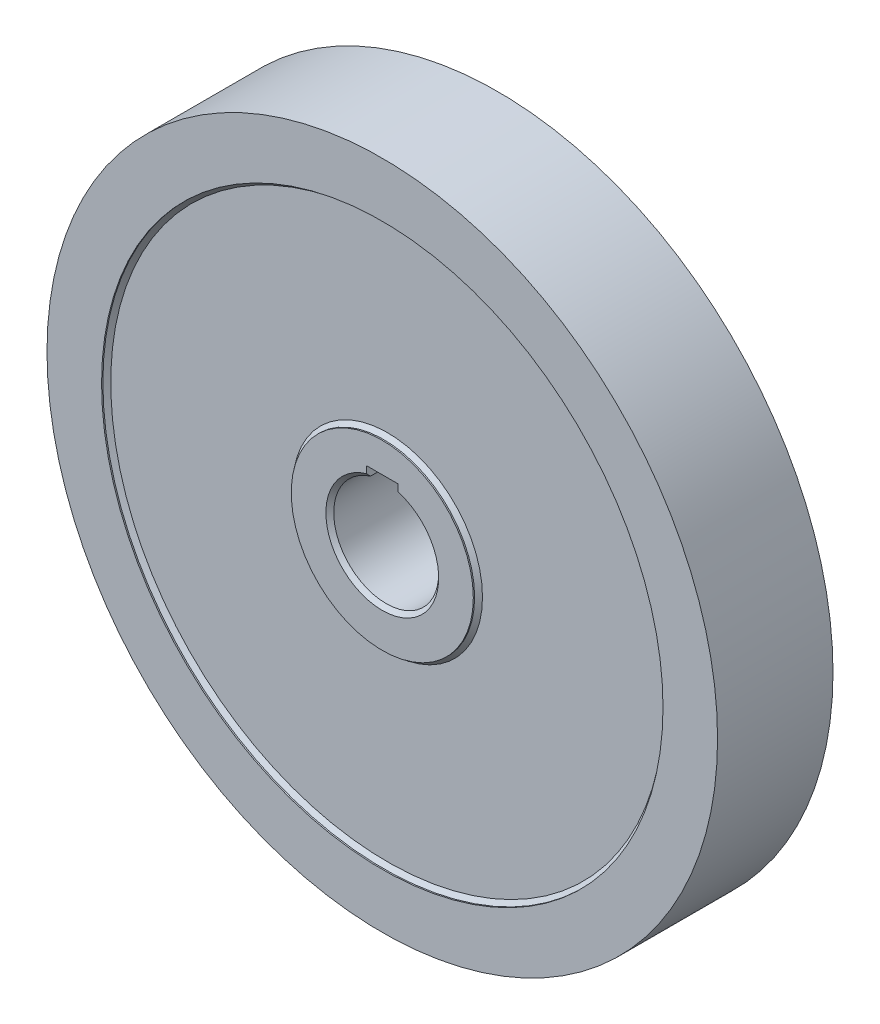
ISO-10303-21;
HEADER;
FILE_DESCRIPTION(('STEP AP214'),'2;1');
FILE_NAME('part.step','',(''),(''),'','','');
FILE_SCHEMA(('AUTOMOTIVE_DESIGN { 1 0 10303 214 1 1 1 1 }'));
ENDSEC;
DATA;
#1=APPLICATION_CONTEXT('core data for automotive mechanical design processes');
#2=APPLICATION_PROTOCOL_DEFINITION('international standard','automotive_design',2000,#1);
#3=PRODUCT_CONTEXT('',#1,'mechanical');
#4=PRODUCT('Part','Part','',(#3));
#5=PRODUCT_RELATED_PRODUCT_CATEGORY('part','',(#4));
#6=PRODUCT_DEFINITION_FORMATION('','',#4);
#7=PRODUCT_DEFINITION_CONTEXT('part definition',#1,'design');
#8=PRODUCT_DEFINITION('design','',#6,#7);
#9=PRODUCT_DEFINITION_SHAPE('','',#8);
#10=(LENGTH_UNIT() NAMED_UNIT(*) SI_UNIT(.MILLI.,.METRE.));
#11=(NAMED_UNIT(*) PLANE_ANGLE_UNIT() SI_UNIT($,.RADIAN.));
#12=(NAMED_UNIT(*) SI_UNIT($,.STERADIAN.) SOLID_ANGLE_UNIT());
#13=UNCERTAINTY_MEASURE_WITH_UNIT(LENGTH_MEASURE(1.E-05),#10,'distance_accuracy_value','');
#14=(GEOMETRIC_REPRESENTATION_CONTEXT(3) GLOBAL_UNCERTAINTY_ASSIGNED_CONTEXT((#13)) GLOBAL_UNIT_ASSIGNED_CONTEXT((#10,
#11,#12)) REPRESENTATION_CONTEXT('',''));
#15=CARTESIAN_POINT('',(0.,0.,0.));
#16=DIRECTION('',(0.,0.,1.));
#17=DIRECTION('',(1.,0.,0.));
#18=AXIS2_PLACEMENT_3D('',#15,#16,#17);
#19=CARTESIAN_POINT('',(0.,0.,-22.));
#20=DIRECTION('',(0.,0.,1.));
#21=DIRECTION('',(1.,0.,0.));
#22=AXIS2_PLACEMENT_3D('',#19,#20,#21);
#23=PLANE('',#22);
#24=DIRECTION('',(0.,-1.,0.));
#25=VECTOR('',#24,1.);
#26=CARTESIAN_POINT('',(-6.,19.0787840283389,-22.));
#27=LINE('',#26,#25);
#28=CARTESIAN_POINT('',(-6.,23.3,-22.));
#29=VERTEX_POINT('',#28);
#30=CARTESIAN_POINT('',(-6.,20.6458228220625,-22.));
#31=VERTEX_POINT('',#30);
#32=EDGE_CURVE('E105',#29,#31,#27,.T.);
#33=ORIENTED_EDGE('',*,*,#32,.T.);
#34=CARTESIAN_POINT('',(0.,0.,-22.));
#35=DIRECTION('',(0.,0.,1.));
#36=DIRECTION('',(1.,0.,0.));
#37=AXIS2_PLACEMENT_3D('',#34,#35,#36);
#38=CIRCLE('',#37,21.4999999999999);
#39=CARTESIAN_POINT('',(6.,20.6458228220625,-22.));
#40=VERTEX_POINT('',#39);
#41=EDGE_CURVE('E182',#31,#40,#38,.T.);
#42=ORIENTED_EDGE('',*,*,#41,.T.);
#43=DIRECTION('',(0.,1.,0.));
#44=VECTOR('',#43,1.);
#45=CARTESIAN_POINT('',(6.,19.0787840283389,-22.));
#46=LINE('',#45,#44);
#47=CARTESIAN_POINT('',(6.,23.3,-22.));
#48=VERTEX_POINT('',#47);
#49=EDGE_CURVE('E115',#40,#48,#46,.T.);
#50=ORIENTED_EDGE('',*,*,#49,.T.);
#51=DIRECTION('',(-1.,0.,0.));
#52=VECTOR('',#51,1.);
#53=CARTESIAN_POINT('',(-6.,23.3,-22.));
#54=LINE('',#53,#52);
#55=EDGE_CURVE('E94',#48,#29,#54,.T.);
#56=ORIENTED_EDGE('',*,*,#55,.T.);
#57=EDGE_LOOP('',(#33,#42,#50,#56));
#58=FACE_BOUND('',#57,.T.);
#59=CARTESIAN_POINT('',(0.,0.,-22.));
#60=DIRECTION('',(0.,0.,1.));
#61=DIRECTION('',(1.,0.,0.));
#62=AXIS2_PLACEMENT_3D('',#59,#60,#61);
#63=CIRCLE('',#62,34.7);
#64=CARTESIAN_POINT('',(34.7,0.,-22.));
#65=VERTEX_POINT('',#64);
#66=EDGE_CURVE('E271',#65,#65,#63,.T.);
#67=ORIENTED_EDGE('',*,*,#66,.F.);
#68=EDGE_LOOP('',(#67));
#69=FACE_BOUND('',#68,.T.);
#70=ADVANCED_FACE('F35',(#58,#69),#23,.F.);
#71=CARTESIAN_POINT('',(0.,0.,22.));
#72=DIRECTION('',(0.,0.,1.));
#73=DIRECTION('',(1.,0.,0.));
#74=AXIS2_PLACEMENT_3D('',#71,#72,#73);
#75=PLANE('',#74);
#76=DIRECTION('',(0.,1.,0.));
#77=VECTOR('',#76,1.);
#78=CARTESIAN_POINT('',(6.,0.,22.));
#79=LINE('',#78,#77);
#80=CARTESIAN_POINT('',(6.,20.6458228220626,22.));
#81=VERTEX_POINT('',#80);
#82=CARTESIAN_POINT('',(6.,23.3,22.));
#83=VERTEX_POINT('',#82);
#84=EDGE_CURVE('E123',#81,#83,#79,.T.);
#85=ORIENTED_EDGE('',*,*,#84,.F.);
#86=CARTESIAN_POINT('',(0.,0.,22.));
#87=DIRECTION('',(0.,0.,1.));
#88=DIRECTION('',(1.,0.,0.));
#89=AXIS2_PLACEMENT_3D('',#86,#87,#88);
#90=CIRCLE('',#89,21.5);
#91=CARTESIAN_POINT('',(-6.,20.6458228220626,22.));
#92=VERTEX_POINT('',#91);
#93=EDGE_CURVE('E158',#81,#92,#90,.F.);
#94=ORIENTED_EDGE('',*,*,#93,.T.);
#95=DIRECTION('',(0.,-1.,0.));
#96=VECTOR('',#95,1.);
#97=CARTESIAN_POINT('',(-6.,0.,22.));
#98=LINE('',#97,#96);
#99=CARTESIAN_POINT('',(-6.,23.3,22.));
#100=VERTEX_POINT('',#99);
#101=EDGE_CURVE('E127',#100,#92,#98,.T.);
#102=ORIENTED_EDGE('',*,*,#101,.F.);
#103=DIRECTION('',(-1.,0.,0.));
#104=VECTOR('',#103,1.);
#105=CARTESIAN_POINT('',(0.,23.3,22.));
#106=LINE('',#105,#104);
#107=EDGE_CURVE('E97',#83,#100,#106,.T.);
#108=ORIENTED_EDGE('',*,*,#107,.F.);
#109=EDGE_LOOP('',(#85,#94,#102,#108));
#110=FACE_BOUND('',#109,.T.);
#111=CARTESIAN_POINT('',(0.,0.,22.));
#112=DIRECTION('',(0.,0.,1.));
#113=DIRECTION('',(1.,0.,0.));
#114=AXIS2_PLACEMENT_3D('',#111,#112,#113);
#115=CIRCLE('',#114,34.7);
#116=CARTESIAN_POINT('',(34.7,0.,22.));
#117=VERTEX_POINT('',#116);
#118=EDGE_CURVE('E266',#117,#117,#115,.T.);
#119=ORIENTED_EDGE('',*,*,#118,.T.);
#120=EDGE_LOOP('',(#119));
#121=FACE_BOUND('',#120,.T.);
#122=ADVANCED_FACE('F217',(#110,#121),#75,.T.);
#123=CARTESIAN_POINT('',(0.,0.,22.));
#124=DIRECTION('',(0.,0.,-1.));
#125=DIRECTION('',(-1.,0.,0.));
#126=AXIS2_PLACEMENT_3D('',#123,#124,#125);
#127=CYLINDRICAL_SURFACE('',#126,127.8);
#128=CARTESIAN_POINT('',(0.,0.,22.));
#129=DIRECTION('',(0.,0.,1.));
#130=DIRECTION('',(1.,0.,0.));
#131=AXIS2_PLACEMENT_3D('',#128,#129,#130);
#132=CIRCLE('',#131,127.8);
#133=CARTESIAN_POINT('',(127.8,0.,22.));
#134=VERTEX_POINT('',#133);
#135=EDGE_CURVE('E130',#134,#134,#132,.T.);
#136=ORIENTED_EDGE('',*,*,#135,.F.);
#137=EDGE_LOOP('',(#136));
#138=FACE_BOUND('',#137,.T.);
#139=CARTESIAN_POINT('',(0.,0.,-22.));
#140=DIRECTION('',(0.,0.,1.));
#141=DIRECTION('',(1.,0.,0.));
#142=AXIS2_PLACEMENT_3D('',#139,#140,#141);
#143=CIRCLE('',#142,127.8);
#144=CARTESIAN_POINT('',(127.8,0.,-22.));
#145=VERTEX_POINT('',#144);
#146=EDGE_CURVE('E129',#145,#145,#143,.T.);
#147=ORIENTED_EDGE('',*,*,#146,.T.);
#148=EDGE_LOOP('',(#147));
#149=FACE_BOUND('',#148,.T.);
#150=ADVANCED_FACE('F233',(#138,#149),#127,.T.);
#151=CARTESIAN_POINT('',(0.,0.,22.));
#152=DIRECTION('',(0.,0.,1.));
#153=DIRECTION('',(1.,0.,0.));
#154=AXIS2_PLACEMENT_3D('',#151,#152,#153);
#155=CIRCLE('',#154,107.);
#156=CARTESIAN_POINT('',(107.,0.,22.));
#157=VERTEX_POINT('',#156);
#158=EDGE_CURVE('E117',#157,#157,#155,.T.);
#159=ORIENTED_EDGE('',*,*,#158,.F.);
#160=EDGE_LOOP('',(#159));
#161=FACE_BOUND('',#160,.T.);
#162=ORIENTED_EDGE('',*,*,#135,.T.);
#163=EDGE_LOOP('',(#162));
#164=FACE_BOUND('',#163,.T.);
#165=ADVANCED_FACE('F226',(#161,#164),#75,.T.);
#166=CARTESIAN_POINT('',(0.,0.,-22.));
#167=DIRECTION('',(0.,0.,1.));
#168=DIRECTION('',(1.,0.,0.));
#169=AXIS2_PLACEMENT_3D('',#166,#167,#168);
#170=CIRCLE('',#169,107.);
#171=CARTESIAN_POINT('',(107.,0.,-22.));
#172=VERTEX_POINT('',#171);
#173=EDGE_CURVE('E267',#172,#172,#170,.T.);
#174=ORIENTED_EDGE('',*,*,#173,.T.);
#175=EDGE_LOOP('',(#174));
#176=FACE_BOUND('',#175,.T.);
#177=ORIENTED_EDGE('',*,*,#146,.F.);
#178=EDGE_LOOP('',(#177));
#179=FACE_BOUND('',#178,.T.);
#180=ADVANCED_FACE('F222',(#176,#179),#23,.F.);
#181=CARTESIAN_POINT('',(0.,0.,-22.));
#182=DIRECTION('',(0.,0.,1.));
#183=DIRECTION('',(1.,0.,0.));
#184=AXIS2_PLACEMENT_3D('',#181,#182,#183);
#185=CYLINDRICAL_SURFACE('',#184,20.);
#186=DIRECTION('',(0.,0.,1.));
#187=VECTOR('',#186,1.);
#188=CARTESIAN_POINT('',(6.,19.0787840283389,-22.));
#189=LINE('',#188,#187);
#190=CARTESIAN_POINT('',(6.,19.0787840283389,-20.5000000000001));
#191=VERTEX_POINT('',#190);
#192=CARTESIAN_POINT('',(6.,19.0787840283389,20.5));
#193=VERTEX_POINT('',#192);
#194=EDGE_CURVE('E112',#191,#193,#189,.T.);
#195=ORIENTED_EDGE('',*,*,#194,.F.);
#196=CARTESIAN_POINT('',(0.,0.,-20.5000000000001));
#197=DIRECTION('',(0.,0.,1.));
#198=DIRECTION('',(1.,0.,0.));
#199=AXIS2_PLACEMENT_3D('',#196,#197,#198);
#200=CIRCLE('',#199,20.);
#201=CARTESIAN_POINT('',(-6.,19.0787840283389,-20.5000000000001));
#202=VERTEX_POINT('',#201);
#203=EDGE_CURVE('E51',#191,#202,#200,.F.);
#204=ORIENTED_EDGE('',*,*,#203,.T.);
#205=DIRECTION('',(0.,0.,1.));
#206=VECTOR('',#205,1.);
#207=CARTESIAN_POINT('',(-6.,19.0787840283389,-22.));
#208=LINE('',#207,#206);
#209=CARTESIAN_POINT('',(-6.,19.0787840283389,20.5));
#210=VERTEX_POINT('',#209);
#211=EDGE_CURVE('E101',#202,#210,#208,.T.);
#212=ORIENTED_EDGE('',*,*,#211,.T.);
#213=CARTESIAN_POINT('',(0.,0.,20.5));
#214=DIRECTION('',(0.,0.,1.));
#215=DIRECTION('',(1.,0.,0.));
#216=AXIS2_PLACEMENT_3D('',#213,#214,#215);
#217=CIRCLE('',#216,20.);
#218=EDGE_CURVE('E147',#210,#193,#217,.T.);
#219=ORIENTED_EDGE('',*,*,#218,.T.);
#220=EDGE_LOOP('',(#195,#204,#212,#219));
#221=FACE_BOUND('',#220,.T.);
#222=ADVANCED_FACE('F172',(#221),#185,.F.);
#223=CARTESIAN_POINT('',(-6.,19.0787840283389,-22.));
#224=DIRECTION('',(-1.,0.,0.));
#225=DIRECTION('',(0.,0.,1.));
#226=AXIS2_PLACEMENT_3D('',#223,#224,#225);
#227=PLANE('',#226);
#228=ORIENTED_EDGE('',*,*,#211,.F.);
#229=CARTESIAN_POINT('',(-6.,19.0787840283389,-20.5000000000001));
#230=CARTESIAN_POINT('',(-6.,19.3403696459277,-20.7495690925491));
#231=CARTESIAN_POINT('',(-6.,19.601749024073,-20.9993536419039));
#232=CARTESIAN_POINT('',(-6.,20.1240952886273,-21.4993536419251));
#233=CARTESIAN_POINT('',(-6.,20.3850621750565,-21.7495690925703));
#234=CARTESIAN_POINT('',(-6.,20.6458228220625,-22.));
#235=B_SPLINE_CURVE_WITH_KNOTS('',3,(#229,#230,#231,#232,#233,#234),.UNSPECIFIED.,.F.,.F.,(4,2,
4),(0.,1.08462136423007,2.16924267509713),.UNSPECIFIED.);
#236=EDGE_CURVE('E108',#202,#31,#235,.T.);
#237=ORIENTED_EDGE('',*,*,#236,.T.);
#238=ORIENTED_EDGE('',*,*,#32,.F.);
#239=DIRECTION('',(0.,0.,1.));
#240=VECTOR('',#239,1.);
#241=CARTESIAN_POINT('',(-6.,23.3,-22.));
#242=LINE('',#241,#240);
#243=EDGE_CURVE('E89',#29,#100,#242,.T.);
#244=ORIENTED_EDGE('',*,*,#243,.T.);
#245=ORIENTED_EDGE('',*,*,#101,.T.);
#246=CARTESIAN_POINT('',(-6.,20.6458228220626,22.));
#247=CARTESIAN_POINT('',(-6.,20.3850621750565,21.7495690925703));
#248=CARTESIAN_POINT('',(-6.,20.1240952886273,21.4993536419251));
#249=CARTESIAN_POINT('',(-6.,19.6017490240731,20.9993536419039));
#250=CARTESIAN_POINT('',(-6.,19.3403696459277,20.7495690925491));
#251=CARTESIAN_POINT('',(-6.,19.0787840283389,20.5));
#252=B_SPLINE_CURVE_WITH_KNOTS('',3,(#246,#247,#248,#249,#250,#251),.UNSPECIFIED.,.F.,.F.,(4,2,
4),(0.,1.0846213108671,2.16924267509722),.UNSPECIFIED.);
#253=EDGE_CURVE('E206',#92,#210,#252,.T.);
#254=ORIENTED_EDGE('',*,*,#253,.T.);
#255=EDGE_LOOP('',(#228,#237,#238,#244,#245,#254));
#256=FACE_BOUND('',#255,.T.);
#257=ADVANCED_FACE('F106',(#256),#227,.F.);
#258=CARTESIAN_POINT('',(-6.,23.3,-22.));
#259=DIRECTION('',(0.,1.,0.));
#260=DIRECTION('',(0.,0.,1.));
#261=AXIS2_PLACEMENT_3D('',#258,#259,#260);
#262=PLANE('',#261);
#263=ORIENTED_EDGE('',*,*,#107,.T.);
#264=ORIENTED_EDGE('',*,*,#243,.F.);
#265=ORIENTED_EDGE('',*,*,#55,.F.);
#266=DIRECTION('',(0.,0.,1.));
#267=VECTOR('',#266,1.);
#268=CARTESIAN_POINT('',(6.,23.3,-22.));
#269=LINE('',#268,#267);
#270=EDGE_CURVE('E102',#48,#83,#269,.T.);
#271=ORIENTED_EDGE('',*,*,#270,.T.);
#272=EDGE_LOOP('',(#263,#264,#265,#271));
#273=FACE_BOUND('',#272,.T.);
#274=ADVANCED_FACE('F91',(#273),#262,.F.);
#275=CARTESIAN_POINT('',(6.,19.0787840283389,-22.));
#276=DIRECTION('',(1.,0.,0.));
#277=DIRECTION('',(0.,0.,-1.));
#278=AXIS2_PLACEMENT_3D('',#275,#276,#277);
#279=PLANE('',#278);
#280=ORIENTED_EDGE('',*,*,#49,.F.);
#281=CARTESIAN_POINT('',(6.,20.6458228220625,-22.));
#282=CARTESIAN_POINT('',(6.,20.3850621750565,-21.7495690925703));
#283=CARTESIAN_POINT('',(6.,20.1240952886273,-21.4993536419251));
#284=CARTESIAN_POINT('',(6.,19.601749024073,-20.9993536419039));
#285=CARTESIAN_POINT('',(6.,19.3403696459277,-20.7495690925491));
#286=CARTESIAN_POINT('',(6.,19.0787840283389,-20.5000000000001));
#287=B_SPLINE_CURVE_WITH_KNOTS('',3,(#281,#282,#283,#284,#285,#286),.UNSPECIFIED.,.F.,.F.,(4,2,
4),(0.,1.08462131086706,2.16924267509713),.UNSPECIFIED.);
#288=EDGE_CURVE('E59',#40,#191,#287,.T.);
#289=ORIENTED_EDGE('',*,*,#288,.T.);
#290=ORIENTED_EDGE('',*,*,#194,.T.);
#291=CARTESIAN_POINT('',(6.,19.0787840283389,20.5));
#292=CARTESIAN_POINT('',(6.,19.3403696459277,20.7495690925491));
#293=CARTESIAN_POINT('',(6.,19.6017490240731,20.9993536419039));
#294=CARTESIAN_POINT('',(6.,20.1240952886273,21.4993536419251));
#295=CARTESIAN_POINT('',(6.,20.3850621750565,21.7495690925703));
#296=CARTESIAN_POINT('',(6.,20.6458228220626,22.));
#297=B_SPLINE_CURVE_WITH_KNOTS('',3,(#291,#292,#293,#294,#295,#296),.UNSPECIFIED.,.F.,.F.,(4,2,
4),(0.,1.08462136423012,2.16924267509722),.UNSPECIFIED.);
#298=EDGE_CURVE('E150',#193,#81,#297,.T.);
#299=ORIENTED_EDGE('',*,*,#298,.T.);
#300=ORIENTED_EDGE('',*,*,#84,.T.);
#301=ORIENTED_EDGE('',*,*,#270,.F.);
#302=EDGE_LOOP('',(#280,#289,#290,#299,#300,#301));
#303=FACE_BOUND('',#302,.T.);
#304=ADVANCED_FACE('F165',(#303),#279,.F.);
#305=CARTESIAN_POINT('',(0.,0.,20.));
#306=DIRECTION('',(0.,0.,1.));
#307=DIRECTION('',(1.,0.,0.));
#308=AXIS2_PLACEMENT_3D('',#305,#306,#307);
#309=CYLINDRICAL_SURFACE('',#308,107.);
#310=CARTESIAN_POINT('',(0.,0.,21.5));
#311=DIRECTION('',(0.,0.,1.));
#312=DIRECTION('',(1.,0.,0.));
#313=AXIS2_PLACEMENT_3D('',#310,#311,#312);
#314=CIRCLE('',#313,107.);
#315=CARTESIAN_POINT('',(107.,0.,21.5));
#316=VERTEX_POINT('',#315);
#317=EDGE_CURVE('E138',#316,#316,#314,.F.);
#318=ORIENTED_EDGE('',*,*,#317,.T.);
#319=EDGE_LOOP('',(#318));
#320=FACE_BOUND('',#319,.T.);
#321=ORIENTED_EDGE('',*,*,#158,.T.);
#322=EDGE_LOOP('',(#321));
#323=FACE_BOUND('',#322,.T.);
#324=ADVANCED_FACE('F170',(#320,#323),#309,.F.);
#325=CARTESIAN_POINT('',(0.,0.,20.));
#326=DIRECTION('',(0.,0.,1.));
#327=DIRECTION('',(1.,0.,0.));
#328=AXIS2_PLACEMENT_3D('',#325,#326,#327);
#329=PLANE('',#328);
#330=CARTESIAN_POINT('',(0.,0.,20.));
#331=DIRECTION('',(0.,0.,1.));
#332=DIRECTION('',(1.,0.,0.));
#333=AXIS2_PLACEMENT_3D('',#330,#331,#332);
#334=CIRCLE('',#333,36.2);
#335=CARTESIAN_POINT('',(36.2,0.,20.));
#336=VERTEX_POINT('',#335);
#337=EDGE_CURVE('E144',#336,#336,#334,.F.);
#338=ORIENTED_EDGE('',*,*,#337,.T.);
#339=EDGE_LOOP('',(#338));
#340=FACE_BOUND('',#339,.T.);
#341=CARTESIAN_POINT('',(0.,0.,20.));
#342=DIRECTION('',(0.,0.,1.));
#343=DIRECTION('',(1.,0.,0.));
#344=AXIS2_PLACEMENT_3D('',#341,#342,#343);
#345=CIRCLE('',#344,105.5);
#346=CARTESIAN_POINT('',(105.5,0.,20.));
#347=VERTEX_POINT('',#346);
#348=EDGE_CURVE('E133',#347,#347,#345,.T.);
#349=ORIENTED_EDGE('',*,*,#348,.T.);
#350=EDGE_LOOP('',(#349));
#351=FACE_BOUND('',#350,.T.);
#352=ADVANCED_FACE('F262',(#340,#351),#329,.T.);
#353=CARTESIAN_POINT('',(0.,0.,20.));
#354=DIRECTION('',(0.,0.,1.));
#355=DIRECTION('',(1.,0.,0.));
#356=AXIS2_PLACEMENT_3D('',#353,#354,#355);
#357=CYLINDRICAL_SURFACE('',#356,34.7);
#358=CARTESIAN_POINT('',(0.,0.,21.5000000000001));
#359=DIRECTION('',(0.,0.,1.));
#360=DIRECTION('',(1.,0.,0.));
#361=AXIS2_PLACEMENT_3D('',#358,#359,#360);
#362=CIRCLE('',#361,34.7);
#363=CARTESIAN_POINT('',(34.7,0.,21.5000000000001));
#364=VERTEX_POINT('',#363);
#365=EDGE_CURVE('E141',#364,#364,#362,.T.);
#366=ORIENTED_EDGE('',*,*,#365,.T.);
#367=EDGE_LOOP('',(#366));
#368=FACE_BOUND('',#367,.T.);
#369=ORIENTED_EDGE('',*,*,#118,.F.);
#370=EDGE_LOOP('',(#369));
#371=FACE_BOUND('',#370,.T.);
#372=ADVANCED_FACE('F258',(#368,#371),#357,.T.);
#373=CARTESIAN_POINT('',(0.,0.,-20.));
#374=DIRECTION('',(0.,0.,-1.));
#375=DIRECTION('',(1.,0.,0.));
#376=AXIS2_PLACEMENT_3D('',#373,#374,#375);
#377=PLANE('',#376);
#378=CARTESIAN_POINT('',(0.,0.,-20.));
#379=DIRECTION('',(0.,0.,-1.));
#380=DIRECTION('',(-1.,0.,0.));
#381=AXIS2_PLACEMENT_3D('',#378,#379,#380);
#382=CIRCLE('',#381,36.2000000000001);
#383=CARTESIAN_POINT('',(-36.2000000000001,0.,-20.));
#384=VERTEX_POINT('',#383);
#385=EDGE_CURVE('E427',#384,#384,#382,.F.);
#386=ORIENTED_EDGE('',*,*,#385,.T.);
#387=EDGE_LOOP('',(#386));
#388=FACE_BOUND('',#387,.T.);
#389=CARTESIAN_POINT('',(0.,0.,-20.));
#390=DIRECTION('',(0.,0.,-1.));
#391=DIRECTION('',(-1.,0.,0.));
#392=AXIS2_PLACEMENT_3D('',#389,#390,#391);
#393=CIRCLE('',#392,105.5);
#394=CARTESIAN_POINT('',(-105.5,0.,-20.));
#395=VERTEX_POINT('',#394);
#396=EDGE_CURVE('E199',#395,#395,#393,.T.);
#397=ORIENTED_EDGE('',*,*,#396,.T.);
#398=EDGE_LOOP('',(#397));
#399=FACE_BOUND('',#398,.T.);
#400=ADVANCED_FACE('F261',(#388,#399),#377,.T.);
#401=CARTESIAN_POINT('',(0.,0.,-20.));
#402=DIRECTION('',(0.,0.,-1.));
#403=DIRECTION('',(-1.,0.,0.));
#404=AXIS2_PLACEMENT_3D('',#401,#402,#403);
#405=CYLINDRICAL_SURFACE('',#404,107.);
#406=CARTESIAN_POINT('',(0.,0.,-21.5));
#407=DIRECTION('',(0.,0.,-1.));
#408=DIRECTION('',(-1.,0.,0.));
#409=AXIS2_PLACEMENT_3D('',#406,#407,#408);
#410=CIRCLE('',#409,107.);
#411=CARTESIAN_POINT('',(-107.,0.,-21.5));
#412=VERTEX_POINT('',#411);
#413=EDGE_CURVE('E11',#412,#412,#410,.F.);
#414=ORIENTED_EDGE('',*,*,#413,.T.);
#415=EDGE_LOOP('',(#414));
#416=FACE_BOUND('',#415,.T.);
#417=ORIENTED_EDGE('',*,*,#173,.F.);
#418=EDGE_LOOP('',(#417));
#419=FACE_BOUND('',#418,.T.);
#420=ADVANCED_FACE('F278',(#416,#419),#405,.F.);
#421=CARTESIAN_POINT('',(0.,0.,-20.));
#422=DIRECTION('',(0.,0.,-1.));
#423=DIRECTION('',(-1.,0.,0.));
#424=AXIS2_PLACEMENT_3D('',#421,#422,#423);
#425=CYLINDRICAL_SURFACE('',#424,34.7);
#426=CARTESIAN_POINT('',(0.,0.,-21.5));
#427=DIRECTION('',(0.,0.,-1.));
#428=DIRECTION('',(-1.,0.,0.));
#429=AXIS2_PLACEMENT_3D('',#426,#427,#428);
#430=CIRCLE('',#429,34.7);
#431=CARTESIAN_POINT('',(-34.7,0.,-21.5));
#432=VERTEX_POINT('',#431);
#433=EDGE_CURVE('E44',#432,#432,#430,.T.);
#434=ORIENTED_EDGE('',*,*,#433,.T.);
#435=EDGE_LOOP('',(#434));
#436=FACE_BOUND('',#435,.T.);
#437=ORIENTED_EDGE('',*,*,#66,.T.);
#438=EDGE_LOOP('',(#437));
#439=FACE_BOUND('',#438,.T.);
#440=ADVANCED_FACE('F245',(#436,#439),#425,.T.);
#441=CARTESIAN_POINT('',(0.,0.,20.));
#442=DIRECTION('',(0.,0.,1.));
#443=DIRECTION('',(1.,0.,0.));
#444=AXIS2_PLACEMENT_3D('',#441,#442,#443);
#445=CONICAL_SURFACE('',#444,105.5,0.785398163397439);
#446=ORIENTED_EDGE('',*,*,#317,.F.);
#447=EDGE_LOOP('',(#446));
#448=FACE_BOUND('',#447,.T.);
#449=ORIENTED_EDGE('',*,*,#348,.F.);
#450=EDGE_LOOP('',(#449));
#451=FACE_BOUND('',#450,.T.);
#452=ADVANCED_FACE('F239',(#448,#451),#445,.F.);
#453=CARTESIAN_POINT('',(0.,0.,21.5000000000001));
#454=DIRECTION('',(0.,0.,-1.));
#455=DIRECTION('',(-1.,0.,0.));
#456=AXIS2_PLACEMENT_3D('',#453,#454,#455);
#457=CONICAL_SURFACE('',#456,34.7,0.785398163397428);
#458=ORIENTED_EDGE('',*,*,#337,.F.);
#459=EDGE_LOOP('',(#458));
#460=FACE_BOUND('',#459,.T.);
#461=ORIENTED_EDGE('',*,*,#365,.F.);
#462=EDGE_LOOP('',(#461));
#463=FACE_BOUND('',#462,.T.);
#464=ADVANCED_FACE('F244',(#460,#463),#457,.T.);
#465=CARTESIAN_POINT('',(0.,0.,20.5));
#466=DIRECTION('',(0.,0.,1.));
#467=DIRECTION('',(1.,0.,0.));
#468=AXIS2_PLACEMENT_3D('',#465,#466,#467);
#469=CONICAL_SURFACE('',#468,20.,0.785398163397464);
#470=ORIENTED_EDGE('',*,*,#253,.F.);
#471=ORIENTED_EDGE('',*,*,#93,.F.);
#472=ORIENTED_EDGE('',*,*,#298,.F.);
#473=ORIENTED_EDGE('',*,*,#218,.F.);
#474=EDGE_LOOP('',(#470,#471,#472,#473));
#475=FACE_BOUND('',#474,.T.);
#476=ADVANCED_FACE('F161',(#475),#469,.F.);
#477=CARTESIAN_POINT('',(0.,0.,-22.));
#478=DIRECTION('',(0.,0.,-1.));
#479=DIRECTION('',(-1.,0.,0.));
#480=AXIS2_PLACEMENT_3D('',#477,#478,#479);
#481=CONICAL_SURFACE('',#480,21.4999999999999,0.785398163397448);
#482=ORIENTED_EDGE('',*,*,#236,.F.);
#483=ORIENTED_EDGE('',*,*,#203,.F.);
#484=ORIENTED_EDGE('',*,*,#288,.F.);
#485=ORIENTED_EDGE('',*,*,#41,.F.);
#486=EDGE_LOOP('',(#482,#483,#484,#485));
#487=FACE_BOUND('',#486,.T.);
#488=ADVANCED_FACE('F185',(#487),#481,.F.);
#489=CARTESIAN_POINT('',(0.,0.,-20.));
#490=DIRECTION('',(0.,0.,1.));
#491=DIRECTION('',(1.,0.,0.));
#492=AXIS2_PLACEMENT_3D('',#489,#490,#491);
#493=CONICAL_SURFACE('',#492,36.2000000000001,0.785398163397469);
#494=ORIENTED_EDGE('',*,*,#433,.F.);
#495=EDGE_LOOP('',(#494));
#496=FACE_BOUND('',#495,.T.);
#497=ORIENTED_EDGE('',*,*,#385,.F.);
#498=EDGE_LOOP('',(#497));
#499=FACE_BOUND('',#498,.T.);
#500=ADVANCED_FACE('F191',(#496,#499),#493,.T.);
#501=CARTESIAN_POINT('',(0.,0.,-21.5));
#502=DIRECTION('',(0.,0.,-1.));
#503=DIRECTION('',(-1.,0.,0.));
#504=AXIS2_PLACEMENT_3D('',#501,#502,#503);
#505=CONICAL_SURFACE('',#504,107.,0.785398163397434);
#506=ORIENTED_EDGE('',*,*,#396,.F.);
#507=EDGE_LOOP('',(#506));
#508=FACE_BOUND('',#507,.T.);
#509=ORIENTED_EDGE('',*,*,#413,.F.);
#510=EDGE_LOOP('',(#509));
#511=FACE_BOUND('',#510,.T.);
#512=ADVANCED_FACE('F38',(#508,#511),#505,.F.);
#513=CLOSED_SHELL('',(#70,#122,#150,#165,#180,#222,#257,#274,#304,#324,#352,#372,#400,#420,#440,
#452,#464,#476,#488,#500,#512));
#514=MANIFOLD_SOLID_BREP('B2',#513);
#515=ADVANCED_BREP_SHAPE_REPRESENTATION('',(#18,#514),#14);
#516=SHAPE_DEFINITION_REPRESENTATION(#9,#515);
ENDSEC;
END-ISO-10303-21;
